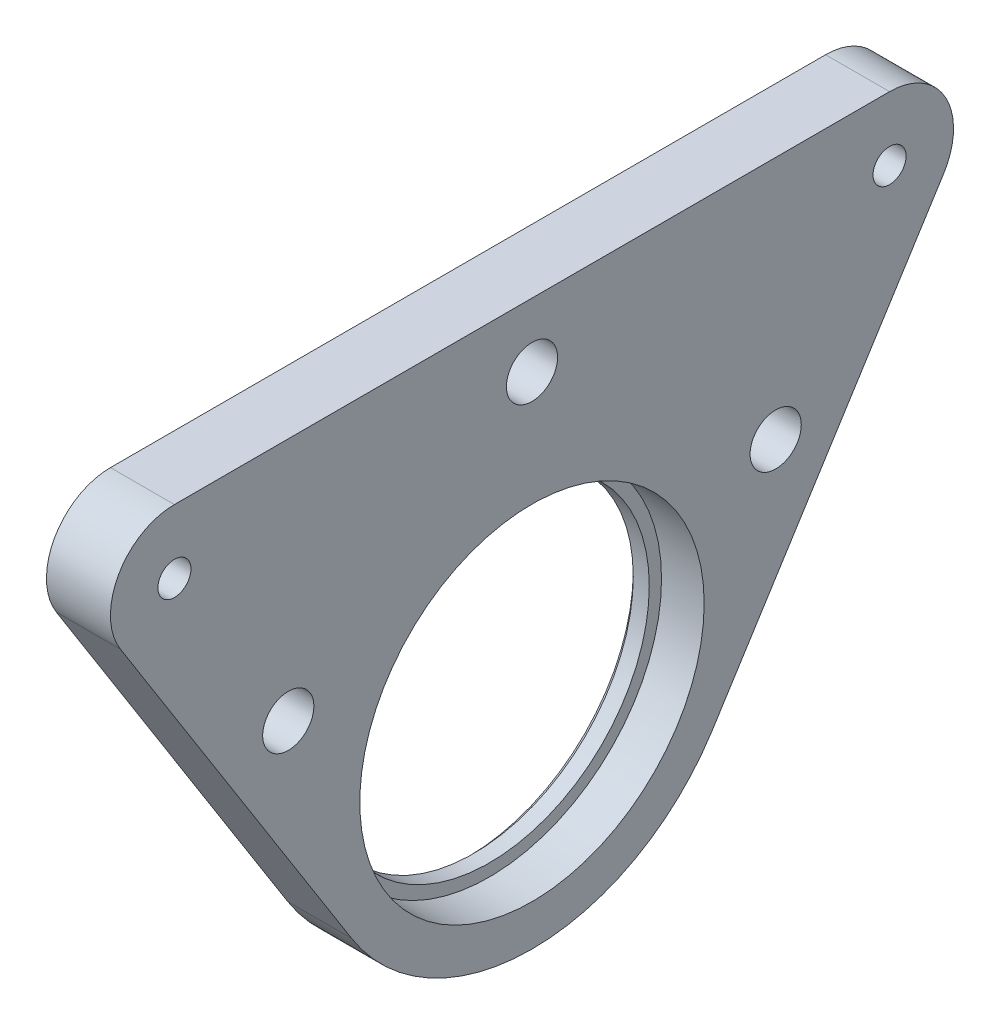
ISO-10303-21;
HEADER;
FILE_DESCRIPTION(('STEP AP214'),'2;1');
FILE_NAME('part.step','',(''),(''),'','','');
FILE_SCHEMA(('AUTOMOTIVE_DESIGN { 1 0 10303 214 1 1 1 1 }'));
ENDSEC;
DATA;
#1=APPLICATION_CONTEXT('core data for automotive mechanical design processes');
#2=APPLICATION_PROTOCOL_DEFINITION('international standard','automotive_design',2000,#1);
#3=PRODUCT_CONTEXT('',#1,'mechanical');
#4=PRODUCT('Part','Part','',(#3));
#5=PRODUCT_RELATED_PRODUCT_CATEGORY('part','',(#4));
#6=PRODUCT_DEFINITION_FORMATION('','',#4);
#7=PRODUCT_DEFINITION_CONTEXT('part definition',#1,'design');
#8=PRODUCT_DEFINITION('design','',#6,#7);
#9=PRODUCT_DEFINITION_SHAPE('','',#8);
#10=(LENGTH_UNIT() NAMED_UNIT(*) SI_UNIT(.MILLI.,.METRE.));
#11=(NAMED_UNIT(*) PLANE_ANGLE_UNIT() SI_UNIT($,.RADIAN.));
#12=(NAMED_UNIT(*) SI_UNIT($,.STERADIAN.) SOLID_ANGLE_UNIT());
#13=UNCERTAINTY_MEASURE_WITH_UNIT(LENGTH_MEASURE(1.E-05),#10,'distance_accuracy_value','');
#14=(GEOMETRIC_REPRESENTATION_CONTEXT(3) GLOBAL_UNCERTAINTY_ASSIGNED_CONTEXT((#13)) GLOBAL_UNIT_ASSIGNED_CONTEXT((#10,
#11,#12)) REPRESENTATION_CONTEXT('',''));
#15=CARTESIAN_POINT('',(0.,0.,0.));
#16=DIRECTION('',(0.,0.,1.));
#17=DIRECTION('',(1.,0.,0.));
#18=AXIS2_PLACEMENT_3D('',#15,#16,#17);
#19=CARTESIAN_POINT('',(2.,0.,0.));
#20=DIRECTION('',(1.,0.,0.));
#21=DIRECTION('',(0.,0.,-1.));
#22=AXIS2_PLACEMENT_3D('',#19,#20,#21);
#23=PLANE('',#22);
#24=CARTESIAN_POINT('',(2.,0.,0.));
#25=DIRECTION('',(1.,0.,0.));
#26=DIRECTION('',(0.,0.,-1.));
#27=AXIS2_PLACEMENT_3D('',#24,#25,#26);
#28=CIRCLE('',#27,15.);
#29=CARTESIAN_POINT('',(2.,0.,-15.));
#30=VERTEX_POINT('',#29);
#31=EDGE_CURVE('E164',#30,#30,#28,.T.);
#32=ORIENTED_EDGE('',*,*,#31,.F.);
#33=EDGE_LOOP('',(#32));
#34=FACE_BOUND('',#33,.T.);
#35=CARTESIAN_POINT('',(2.,0.,0.));
#36=DIRECTION('',(1.,0.,0.));
#37=DIRECTION('',(0.,0.,-1.));
#38=AXIS2_PLACEMENT_3D('',#35,#36,#37);
#39=CIRCLE('',#38,16.15);
#40=CARTESIAN_POINT('',(2.,0.,-16.15));
#41=VERTEX_POINT('',#40);
#42=EDGE_CURVE('E263',#41,#41,#39,.F.);
#43=ORIENTED_EDGE('',*,*,#42,.F.);
#44=EDGE_LOOP('',(#43));
#45=FACE_BOUND('',#44,.T.);
#46=ADVANCED_FACE('F47',(#34,#45),#23,.T.);
#47=CARTESIAN_POINT('',(0.,0.,0.));
#48=DIRECTION('',(1.,0.,0.));
#49=DIRECTION('',(0.,0.,-1.));
#50=AXIS2_PLACEMENT_3D('',#47,#48,#49);
#51=PLANE('',#50);
#52=CARTESIAN_POINT('',(0.,0.,0.));
#53=DIRECTION('',(1.,0.,0.));
#54=DIRECTION('',(0.,0.,-1.));
#55=AXIS2_PLACEMENT_3D('',#52,#53,#54);
#56=CIRCLE('',#55,15.5);
#57=CARTESIAN_POINT('',(0.,0.,-15.5));
#58=VERTEX_POINT('',#57);
#59=EDGE_CURVE('E57',#58,#58,#56,.T.);
#60=ORIENTED_EDGE('',*,*,#59,.T.);
#61=EDGE_LOOP('',(#60));
#62=FACE_BOUND('',#61,.T.);
#63=CARTESIAN_POINT('',(0.,9.97181490150372,22.856187860574));
#64=DIRECTION('',(1.,0.,0.));
#65=DIRECTION('',(0.,0.,-1.));
#66=AXIS2_PLACEMENT_3D('',#63,#64,#65);
#67=CIRCLE('',#66,2.4);
#68=CARTESIAN_POINT('',(0.,9.97181490150372,20.456187860574));
#69=VERTEX_POINT('',#68);
#70=EDGE_CURVE('E129',#69,#69,#67,.F.);
#71=ORIENTED_EDGE('',*,*,#70,.F.);
#72=EDGE_LOOP('',(#71));
#73=FACE_BOUND('',#72,.T.);
#74=CARTESIAN_POINT('',(0.,9.97181490150372,-22.856187860574));
#75=DIRECTION('',(1.,0.,0.));
#76=DIRECTION('',(0.,0.,-1.));
#77=AXIS2_PLACEMENT_3D('',#74,#75,#76);
#78=CIRCLE('',#77,2.4);
#79=CARTESIAN_POINT('',(0.,9.97181490150372,-25.256187860574));
#80=VERTEX_POINT('',#79);
#81=EDGE_CURVE('E235',#80,#80,#78,.F.);
#82=ORIENTED_EDGE('',*,*,#81,.F.);
#83=EDGE_LOOP('',(#82));
#84=FACE_BOUND('',#83,.T.);
#85=CARTESIAN_POINT('',(0.,26.8817099586865,0.));
#86=DIRECTION('',(1.,0.,0.));
#87=DIRECTION('',(0.,0.,-1.));
#88=AXIS2_PLACEMENT_3D('',#85,#86,#87);
#89=CIRCLE('',#88,2.4);
#90=CARTESIAN_POINT('',(0.,26.8817099586865,-2.4));
#91=VERTEX_POINT('',#90);
#92=EDGE_CURVE('E236',#91,#91,#89,.F.);
#93=ORIENTED_EDGE('',*,*,#92,.F.);
#94=EDGE_LOOP('',(#93));
#95=FACE_BOUND('',#94,.T.);
#96=CARTESIAN_POINT('',(0.,0.,0.));
#97=DIRECTION('',(1.,0.,0.));
#98=DIRECTION('',(0.,0.,-1.));
#99=AXIS2_PLACEMENT_3D('',#96,#97,#98);
#100=CIRCLE('',#99,20.);
#101=CARTESIAN_POINT('',(0.,-10.6796745809535,16.9098950571828));
#102=VERTEX_POINT('',#101);
#103=CARTESIAN_POINT('',(0.,-10.6796745809535,-16.9098950571828));
#104=VERTEX_POINT('',#103);
#105=EDGE_CURVE('E168',#102,#104,#100,.T.);
#106=ORIENTED_EDGE('',*,*,#105,.F.);
#107=DIRECTION('',(0.,0.845494752859142,0.533983729047674));
#108=VECTOR('',#107,1.);
#109=CARTESIAN_POINT('',(0.,23.6778075844005,38.6088309586823));
#110=LINE('',#109,#108);
#111=CARTESIAN_POINT('',(0.,23.6778075844005,38.6088309586823));
#112=VERTEX_POINT('',#111);
#113=EDGE_CURVE('E88',#102,#112,#110,.T.);
#114=ORIENTED_EDGE('',*,*,#113,.T.);
#115=CARTESIAN_POINT('',(0.,26.8817099586865,33.5358624415275));
#116=DIRECTION('',(1.,0.,0.));
#117=DIRECTION('',(0.,0.,-1.));
#118=AXIS2_PLACEMENT_3D('',#115,#116,#117);
#119=CIRCLE('',#118,6.);
#120=CARTESIAN_POINT('',(0.,32.8817099586866,33.5358624415275));
#121=VERTEX_POINT('',#120);
#122=EDGE_CURVE('E73',#112,#121,#119,.F.);
#123=ORIENTED_EDGE('',*,*,#122,.T.);
#124=DIRECTION('',(0.,0.,-1.));
#125=VECTOR('',#124,1.);
#126=CARTESIAN_POINT('',(0.,32.8817099586866,33.5358624415275));
#127=LINE('',#126,#125);
#128=CARTESIAN_POINT('',(0.,32.8817099586866,-33.5358624415275));
#129=VERTEX_POINT('',#128);
#130=EDGE_CURVE('E221',#121,#129,#127,.T.);
#131=ORIENTED_EDGE('',*,*,#130,.T.);
#132=CARTESIAN_POINT('',(0.,26.8817099586866,-33.5358624415275));
#133=DIRECTION('',(1.,0.,0.));
#134=DIRECTION('',(0.,0.,-1.));
#135=AXIS2_PLACEMENT_3D('',#132,#133,#134);
#136=CIRCLE('',#135,6.00000000000001);
#137=CARTESIAN_POINT('',(0.,23.6778075844005,-38.6088309586823));
#138=VERTEX_POINT('',#137);
#139=EDGE_CURVE('E219',#129,#138,#136,.F.);
#140=ORIENTED_EDGE('',*,*,#139,.T.);
#141=DIRECTION('',(0.,-0.845494752859142,0.533983729047674));
#142=VECTOR('',#141,1.);
#143=CARTESIAN_POINT('',(0.,-10.6796745809535,-16.9098950571828));
#144=LINE('',#143,#142);
#145=EDGE_CURVE('E148',#138,#104,#144,.T.);
#146=ORIENTED_EDGE('',*,*,#145,.T.);
#147=EDGE_LOOP('',(#106,#114,#123,#131,#140,#146));
#148=FACE_BOUND('',#147,.T.);
#149=CARTESIAN_POINT('',(0.,26.8817099586866,-33.5358624415275));
#150=DIRECTION('',(1.,0.,0.));
#151=DIRECTION('',(0.,0.,-1.));
#152=AXIS2_PLACEMENT_3D('',#149,#150,#151);
#153=CIRCLE('',#152,1.55);
#154=CARTESIAN_POINT('',(0.,26.8817099586866,-35.0858624415275));
#155=VERTEX_POINT('',#154);
#156=EDGE_CURVE('E240',#155,#155,#153,.T.);
#157=ORIENTED_EDGE('',*,*,#156,.T.);
#158=EDGE_LOOP('',(#157));
#159=FACE_BOUND('',#158,.T.);
#160=CARTESIAN_POINT('',(0.,26.8817099586865,33.5358624415275));
#161=DIRECTION('',(1.,0.,0.));
#162=DIRECTION('',(0.,0.,-1.));
#163=AXIS2_PLACEMENT_3D('',#160,#161,#162);
#164=CIRCLE('',#163,1.55);
#165=CARTESIAN_POINT('',(0.,26.8817099586865,31.9858624415275));
#166=VERTEX_POINT('',#165);
#167=EDGE_CURVE('E259',#166,#166,#164,.T.);
#168=ORIENTED_EDGE('',*,*,#167,.T.);
#169=EDGE_LOOP('',(#168));
#170=FACE_BOUND('',#169,.T.);
#171=ADVANCED_FACE('F175',(#62,#73,#84,#95,#148,#159,#170),#51,.F.);
#172=CARTESIAN_POINT('',(2.,0.,0.));
#173=DIRECTION('',(-1.,0.,0.));
#174=DIRECTION('',(0.,0.,1.));
#175=AXIS2_PLACEMENT_3D('',#172,#173,#174);
#176=CYLINDRICAL_SURFACE('',#175,20.);
#177=CARTESIAN_POINT('',(6.,0.,0.));
#178=DIRECTION('',(1.,0.,0.));
#179=DIRECTION('',(0.,0.,-1.));
#180=AXIS2_PLACEMENT_3D('',#177,#178,#179);
#181=CIRCLE('',#180,20.);
#182=CARTESIAN_POINT('',(6.,-10.6796745809535,16.9098950571828));
#183=VERTEX_POINT('',#182);
#184=CARTESIAN_POINT('',(6.,-10.6796745809535,-16.9098950571828));
#185=VERTEX_POINT('',#184);
#186=EDGE_CURVE('E161',#183,#185,#181,.T.);
#187=ORIENTED_EDGE('',*,*,#186,.F.);
#188=DIRECTION('',(1.,0.,0.));
#189=VECTOR('',#188,1.);
#190=CARTESIAN_POINT('',(-90.2769732489516,-10.6796745809535,16.9098950571828));
#191=LINE('',#190,#189);
#192=EDGE_CURVE('E117',#102,#183,#191,.T.);
#193=ORIENTED_EDGE('',*,*,#192,.F.);
#194=ORIENTED_EDGE('',*,*,#105,.T.);
#195=DIRECTION('',(1.,0.,0.));
#196=VECTOR('',#195,1.);
#197=CARTESIAN_POINT('',(-90.2769732489516,-10.6796745809535,-16.9098950571828));
#198=LINE('',#197,#196);
#199=EDGE_CURVE('E155',#104,#185,#198,.T.);
#200=ORIENTED_EDGE('',*,*,#199,.T.);
#201=EDGE_LOOP('',(#187,#193,#194,#200));
#202=FACE_BOUND('',#201,.T.);
#203=ADVANCED_FACE('F195',(#202),#176,.T.);
#204=CARTESIAN_POINT('',(2.,0.,0.));
#205=DIRECTION('',(-1.,0.,0.));
#206=DIRECTION('',(0.,0.,1.));
#207=AXIS2_PLACEMENT_3D('',#204,#205,#206);
#208=CYLINDRICAL_SURFACE('',#207,15.);
#209=CARTESIAN_POINT('',(0.49999999999999,0.,0.));
#210=DIRECTION('',(1.,0.,0.));
#211=DIRECTION('',(0.,0.,-1.));
#212=AXIS2_PLACEMENT_3D('',#209,#210,#211);
#213=CIRCLE('',#212,15.);
#214=CARTESIAN_POINT('',(0.49999999999999,0.,-15.));
#215=VERTEX_POINT('',#214);
#216=EDGE_CURVE('E11',#215,#215,#213,.F.);
#217=ORIENTED_EDGE('',*,*,#216,.T.);
#218=EDGE_LOOP('',(#217));
#219=FACE_BOUND('',#218,.T.);
#220=ORIENTED_EDGE('',*,*,#31,.T.);
#221=EDGE_LOOP('',(#220));
#222=FACE_BOUND('',#221,.T.);
#223=ADVANCED_FACE('F200',(#219,#222),#208,.F.);
#224=CARTESIAN_POINT('',(6.,0.,0.));
#225=DIRECTION('',(1.,0.,0.));
#226=DIRECTION('',(0.,0.,-1.));
#227=AXIS2_PLACEMENT_3D('',#224,#225,#226);
#228=PLANE('',#227);
#229=CARTESIAN_POINT('',(6.,0.,0.));
#230=DIRECTION('',(1.,0.,0.));
#231=DIRECTION('',(0.,0.,-1.));
#232=AXIS2_PLACEMENT_3D('',#229,#230,#231);
#233=CIRCLE('',#232,16.15);
#234=CARTESIAN_POINT('',(6.,0.,-16.15));
#235=VERTEX_POINT('',#234);
#236=EDGE_CURVE('E267',#235,#235,#233,.T.);
#237=ORIENTED_EDGE('',*,*,#236,.F.);
#238=EDGE_LOOP('',(#237));
#239=FACE_BOUND('',#238,.T.);
#240=CARTESIAN_POINT('',(6.,9.97181490150372,22.856187860574));
#241=DIRECTION('',(1.,0.,0.));
#242=DIRECTION('',(0.,0.,-1.));
#243=AXIS2_PLACEMENT_3D('',#240,#241,#242);
#244=CIRCLE('',#243,2.4);
#245=CARTESIAN_POINT('',(6.,9.97181490150372,20.456187860574));
#246=VERTEX_POINT('',#245);
#247=EDGE_CURVE('E133',#246,#246,#244,.T.);
#248=ORIENTED_EDGE('',*,*,#247,.F.);
#249=EDGE_LOOP('',(#248));
#250=FACE_BOUND('',#249,.T.);
#251=CARTESIAN_POINT('',(6.,9.97181490150372,-22.856187860574));
#252=DIRECTION('',(1.,0.,0.));
#253=DIRECTION('',(0.,0.,1.));
#254=AXIS2_PLACEMENT_3D('',#251,#252,#253);
#255=CIRCLE('',#254,2.4);
#256=CARTESIAN_POINT('',(6.,9.97181490150372,-20.456187860574));
#257=VERTEX_POINT('',#256);
#258=EDGE_CURVE('E241',#257,#257,#255,.T.);
#259=ORIENTED_EDGE('',*,*,#258,.F.);
#260=EDGE_LOOP('',(#259));
#261=FACE_BOUND('',#260,.T.);
#262=CARTESIAN_POINT('',(6.,26.8817099586865,0.));
#263=DIRECTION('',(1.,0.,0.));
#264=DIRECTION('',(0.,0.,-1.));
#265=AXIS2_PLACEMENT_3D('',#262,#263,#264);
#266=CIRCLE('',#265,2.4);
#267=CARTESIAN_POINT('',(6.,26.8817099586865,-2.4));
#268=VERTEX_POINT('',#267);
#269=EDGE_CURVE('E231',#268,#268,#266,.T.);
#270=ORIENTED_EDGE('',*,*,#269,.F.);
#271=EDGE_LOOP('',(#270));
#272=FACE_BOUND('',#271,.T.);
#273=ORIENTED_EDGE('',*,*,#186,.T.);
#274=DIRECTION('',(0.,0.845494752859141,-0.533983729047674));
#275=VECTOR('',#274,1.);
#276=CARTESIAN_POINT('',(6.,-10.6796745809535,-16.9098950571828));
#277=LINE('',#276,#275);
#278=CARTESIAN_POINT('',(6.,23.6778075844005,-38.6088309586823));
#279=VERTEX_POINT('',#278);
#280=EDGE_CURVE('E123',#185,#279,#277,.T.);
#281=ORIENTED_EDGE('',*,*,#280,.T.);
#282=CARTESIAN_POINT('',(6.,26.8817099586866,-33.5358624415275));
#283=DIRECTION('',(1.,0.,0.));
#284=DIRECTION('',(0.,0.,-1.));
#285=AXIS2_PLACEMENT_3D('',#282,#283,#284);
#286=CIRCLE('',#285,6.00000000000001);
#287=CARTESIAN_POINT('',(6.,32.8817099586866,-33.5358624415275));
#288=VERTEX_POINT('',#287);
#289=EDGE_CURVE('E141',#279,#288,#286,.T.);
#290=ORIENTED_EDGE('',*,*,#289,.T.);
#291=DIRECTION('',(0.,0.,1.));
#292=VECTOR('',#291,1.);
#293=CARTESIAN_POINT('',(6.,32.8817099586866,33.5358624415275));
#294=LINE('',#293,#292);
#295=CARTESIAN_POINT('',(6.,32.8817099586866,33.5358624415275));
#296=VERTEX_POINT('',#295);
#297=EDGE_CURVE('E118',#288,#296,#294,.T.);
#298=ORIENTED_EDGE('',*,*,#297,.T.);
#299=CARTESIAN_POINT('',(6.,26.8817099586865,33.5358624415275));
#300=DIRECTION('',(1.,0.,0.));
#301=DIRECTION('',(0.,0.,-1.));
#302=AXIS2_PLACEMENT_3D('',#299,#300,#301);
#303=CIRCLE('',#302,6.);
#304=CARTESIAN_POINT('',(6.,23.6778075844005,38.6088309586823));
#305=VERTEX_POINT('',#304);
#306=EDGE_CURVE('E114',#296,#305,#303,.T.);
#307=ORIENTED_EDGE('',*,*,#306,.T.);
#308=DIRECTION('',(0.,-0.845494752859141,-0.533983729047673));
#309=VECTOR('',#308,1.);
#310=CARTESIAN_POINT('',(6.,23.6778075844005,38.6088309586823));
#311=LINE('',#310,#309);
#312=EDGE_CURVE('E64',#305,#183,#311,.T.);
#313=ORIENTED_EDGE('',*,*,#312,.T.);
#314=EDGE_LOOP('',(#273,#281,#290,#298,#307,#313));
#315=FACE_BOUND('',#314,.T.);
#316=CARTESIAN_POINT('',(6.,26.8817099586866,-33.5358624415275));
#317=DIRECTION('',(1.,0.,0.));
#318=DIRECTION('',(0.,0.,-1.));
#319=AXIS2_PLACEMENT_3D('',#316,#317,#318);
#320=CIRCLE('',#319,1.55);
#321=CARTESIAN_POINT('',(6.,26.8817099586866,-35.0858624415275));
#322=VERTEX_POINT('',#321);
#323=EDGE_CURVE('E251',#322,#322,#320,.T.);
#324=ORIENTED_EDGE('',*,*,#323,.F.);
#325=EDGE_LOOP('',(#324));
#326=FACE_BOUND('',#325,.T.);
#327=CARTESIAN_POINT('',(6.,26.8817099586865,33.5358624415275));
#328=DIRECTION('',(1.,0.,0.));
#329=DIRECTION('',(0.,0.,-1.));
#330=AXIS2_PLACEMENT_3D('',#327,#328,#329);
#331=CIRCLE('',#330,1.55);
#332=CARTESIAN_POINT('',(6.,26.8817099586865,31.9858624415275));
#333=VERTEX_POINT('',#332);
#334=EDGE_CURVE('E255',#333,#333,#331,.T.);
#335=ORIENTED_EDGE('',*,*,#334,.F.);
#336=EDGE_LOOP('',(#335));
#337=FACE_BOUND('',#336,.T.);
#338=ADVANCED_FACE('F125',(#239,#250,#261,#272,#315,#326,#337),#228,.T.);
#339=CARTESIAN_POINT('',(-90.2769732489516,23.6778075844005,38.6088309586823));
#340=DIRECTION('',(0.,-0.533983729047673,0.845494752859141));
#341=DIRECTION('',(0.,-0.845494752859142,-0.533983729047674));
#342=AXIS2_PLACEMENT_3D('',#339,#340,#341);
#343=PLANE('',#342);
#344=ORIENTED_EDGE('',*,*,#113,.F.);
#345=ORIENTED_EDGE('',*,*,#192,.T.);
#346=ORIENTED_EDGE('',*,*,#312,.F.);
#347=DIRECTION('',(1.,0.,0.));
#348=VECTOR('',#347,1.);
#349=CARTESIAN_POINT('',(-90.2769732489516,23.6778075844005,38.6088309586823));
#350=LINE('',#349,#348);
#351=EDGE_CURVE('E112',#112,#305,#350,.T.);
#352=ORIENTED_EDGE('',*,*,#351,.F.);
#353=EDGE_LOOP('',(#344,#345,#346,#352));
#354=FACE_BOUND('',#353,.T.);
#355=ADVANCED_FACE('F120',(#354),#343,.T.);
#356=CARTESIAN_POINT('',(-90.2769732489516,-10.6796745809535,-16.9098950571828));
#357=DIRECTION('',(0.,-0.533983729047674,-0.845494752859141));
#358=DIRECTION('',(0.,0.845494752859142,-0.533983729047674));
#359=AXIS2_PLACEMENT_3D('',#356,#357,#358);
#360=PLANE('',#359);
#361=ORIENTED_EDGE('',*,*,#145,.F.);
#362=DIRECTION('',(1.,0.,0.));
#363=VECTOR('',#362,1.);
#364=CARTESIAN_POINT('',(-90.2769732489516,23.6778075844005,-38.6088309586823));
#365=LINE('',#364,#363);
#366=EDGE_CURVE('E152',#138,#279,#365,.T.);
#367=ORIENTED_EDGE('',*,*,#366,.T.);
#368=ORIENTED_EDGE('',*,*,#280,.F.);
#369=ORIENTED_EDGE('',*,*,#199,.F.);
#370=EDGE_LOOP('',(#361,#367,#368,#369));
#371=FACE_BOUND('',#370,.T.);
#372=ADVANCED_FACE('F213',(#371),#360,.T.);
#373=CARTESIAN_POINT('',(-90.2769732489516,26.8817099586866,-33.5358624415275));
#374=DIRECTION('',(1.,0.,0.));
#375=DIRECTION('',(0.,0.,-1.));
#376=AXIS2_PLACEMENT_3D('',#373,#374,#375);
#377=CYLINDRICAL_SURFACE('',#376,6.00000000000001);
#378=ORIENTED_EDGE('',*,*,#139,.F.);
#379=DIRECTION('',(1.,0.,0.));
#380=VECTOR('',#379,1.);
#381=CARTESIAN_POINT('',(-90.2769732489516,32.8817099586866,-33.5358624415275));
#382=LINE('',#381,#380);
#383=EDGE_CURVE('E149',#129,#288,#382,.T.);
#384=ORIENTED_EDGE('',*,*,#383,.T.);
#385=ORIENTED_EDGE('',*,*,#289,.F.);
#386=ORIENTED_EDGE('',*,*,#366,.F.);
#387=EDGE_LOOP('',(#378,#384,#385,#386));
#388=FACE_BOUND('',#387,.T.);
#389=ADVANCED_FACE('F217',(#388),#377,.T.);
#390=CARTESIAN_POINT('',(-90.2769732489516,32.8817099586866,33.5358624415275));
#391=DIRECTION('',(0.,1.,0.));
#392=DIRECTION('',(0.,0.,1.));
#393=AXIS2_PLACEMENT_3D('',#390,#391,#392);
#394=PLANE('',#393);
#395=ORIENTED_EDGE('',*,*,#130,.F.);
#396=DIRECTION('',(1.,0.,0.));
#397=VECTOR('',#396,1.);
#398=CARTESIAN_POINT('',(-90.2769732489516,32.8817099586866,33.5358624415275));
#399=LINE('',#398,#397);
#400=EDGE_CURVE('E98',#121,#296,#399,.T.);
#401=ORIENTED_EDGE('',*,*,#400,.T.);
#402=ORIENTED_EDGE('',*,*,#297,.F.);
#403=ORIENTED_EDGE('',*,*,#383,.F.);
#404=EDGE_LOOP('',(#395,#401,#402,#403));
#405=FACE_BOUND('',#404,.T.);
#406=ADVANCED_FACE('F220',(#405),#394,.T.);
#407=CARTESIAN_POINT('',(-90.2769732489516,26.8817099586865,33.5358624415275));
#408=DIRECTION('',(1.,0.,0.));
#409=DIRECTION('',(0.,0.,-1.));
#410=AXIS2_PLACEMENT_3D('',#407,#408,#409);
#411=CYLINDRICAL_SURFACE('',#410,6.);
#412=ORIENTED_EDGE('',*,*,#122,.F.);
#413=ORIENTED_EDGE('',*,*,#351,.T.);
#414=ORIENTED_EDGE('',*,*,#306,.F.);
#415=ORIENTED_EDGE('',*,*,#400,.F.);
#416=EDGE_LOOP('',(#412,#413,#414,#415));
#417=FACE_BOUND('',#416,.T.);
#418=ADVANCED_FACE('F113',(#417),#411,.T.);
#419=CARTESIAN_POINT('',(-6.78822509939086,26.8817099586865,0.));
#420=DIRECTION('',(1.,0.,0.));
#421=DIRECTION('',(0.,0.,-1.));
#422=AXIS2_PLACEMENT_3D('',#419,#420,#421);
#423=CYLINDRICAL_SURFACE('',#422,2.4);
#424=ORIENTED_EDGE('',*,*,#92,.T.);
#425=EDGE_LOOP('',(#424));
#426=FACE_BOUND('',#425,.T.);
#427=ORIENTED_EDGE('',*,*,#269,.T.);
#428=EDGE_LOOP('',(#427));
#429=FACE_BOUND('',#428,.T.);
#430=ADVANCED_FACE('F285',(#426,#429),#423,.F.);
#431=CARTESIAN_POINT('',(-6.78822509939086,9.97181490150372,-22.856187860574));
#432=DIRECTION('',(1.,0.,0.));
#433=DIRECTION('',(0.,0.,-1.));
#434=AXIS2_PLACEMENT_3D('',#431,#432,#433);
#435=CYLINDRICAL_SURFACE('',#434,2.4);
#436=ORIENTED_EDGE('',*,*,#81,.T.);
#437=EDGE_LOOP('',(#436));
#438=FACE_BOUND('',#437,.T.);
#439=ORIENTED_EDGE('',*,*,#258,.T.);
#440=EDGE_LOOP('',(#439));
#441=FACE_BOUND('',#440,.T.);
#442=ADVANCED_FACE('F287',(#438,#441),#435,.F.);
#443=CARTESIAN_POINT('',(-6.78822509939086,9.97181490150372,22.856187860574));
#444=DIRECTION('',(1.,0.,0.));
#445=DIRECTION('',(0.,0.,-1.));
#446=AXIS2_PLACEMENT_3D('',#443,#444,#445);
#447=CYLINDRICAL_SURFACE('',#446,2.4);
#448=ORIENTED_EDGE('',*,*,#70,.T.);
#449=EDGE_LOOP('',(#448));
#450=FACE_BOUND('',#449,.T.);
#451=ORIENTED_EDGE('',*,*,#247,.T.);
#452=EDGE_LOOP('',(#451));
#453=FACE_BOUND('',#452,.T.);
#454=ADVANCED_FACE('F294',(#450,#453),#447,.F.);
#455=CARTESIAN_POINT('',(11.6568542494924,26.8817099586866,-33.5358624415275));
#456=DIRECTION('',(-1.,0.,0.));
#457=DIRECTION('',(0.,0.,1.));
#458=AXIS2_PLACEMENT_3D('',#455,#456,#457);
#459=CYLINDRICAL_SURFACE('',#458,1.55);
#460=ORIENTED_EDGE('',*,*,#156,.F.);
#461=EDGE_LOOP('',(#460));
#462=FACE_BOUND('',#461,.T.);
#463=ORIENTED_EDGE('',*,*,#323,.T.);
#464=EDGE_LOOP('',(#463));
#465=FACE_BOUND('',#464,.T.);
#466=ADVANCED_FACE('F348',(#462,#465),#459,.F.);
#467=CARTESIAN_POINT('',(11.6568542494924,26.8817099586865,33.5358624415275));
#468=DIRECTION('',(-1.,0.,0.));
#469=DIRECTION('',(0.,0.,1.));
#470=AXIS2_PLACEMENT_3D('',#467,#468,#469);
#471=CYLINDRICAL_SURFACE('',#470,1.55);
#472=ORIENTED_EDGE('',*,*,#167,.F.);
#473=EDGE_LOOP('',(#472));
#474=FACE_BOUND('',#473,.T.);
#475=ORIENTED_EDGE('',*,*,#334,.T.);
#476=EDGE_LOOP('',(#475));
#477=FACE_BOUND('',#476,.T.);
#478=ADVANCED_FACE('F184',(#474,#477),#471,.F.);
#479=CARTESIAN_POINT('',(-43.679098064651,0.,0.));
#480=DIRECTION('',(1.,0.,0.));
#481=DIRECTION('',(0.,0.,-1.));
#482=AXIS2_PLACEMENT_3D('',#479,#480,#481);
#483=CYLINDRICAL_SURFACE('',#482,16.15);
#484=ORIENTED_EDGE('',*,*,#42,.T.);
#485=EDGE_LOOP('',(#484));
#486=FACE_BOUND('',#485,.T.);
#487=ORIENTED_EDGE('',*,*,#236,.T.);
#488=EDGE_LOOP('',(#487));
#489=FACE_BOUND('',#488,.T.);
#490=ADVANCED_FACE('F179',(#486,#489),#483,.F.);
#491=CARTESIAN_POINT('',(0.,0.,0.));
#492=DIRECTION('',(-1.,0.,0.));
#493=DIRECTION('',(0.,0.,1.));
#494=AXIS2_PLACEMENT_3D('',#491,#492,#493);
#495=CONICAL_SURFACE('',#494,15.5,0.785398163397443);
#496=ORIENTED_EDGE('',*,*,#216,.F.);
#497=EDGE_LOOP('',(#496));
#498=FACE_BOUND('',#497,.T.);
#499=ORIENTED_EDGE('',*,*,#59,.F.);
#500=EDGE_LOOP('',(#499));
#501=FACE_BOUND('',#500,.T.);
#502=ADVANCED_FACE('F50',(#498,#501),#495,.F.);
#503=CLOSED_SHELL('',(#46,#171,#203,#223,#338,#355,#372,#389,#406,#418,#430,#442,#454,#466,#478,
#490,#502));
#504=MANIFOLD_SOLID_BREP('B2',#503);
#505=ADVANCED_BREP_SHAPE_REPRESENTATION('',(#18,#504),#14);
#506=SHAPE_DEFINITION_REPRESENTATION(#9,#505);
ENDSEC;
END-ISO-10303-21;
